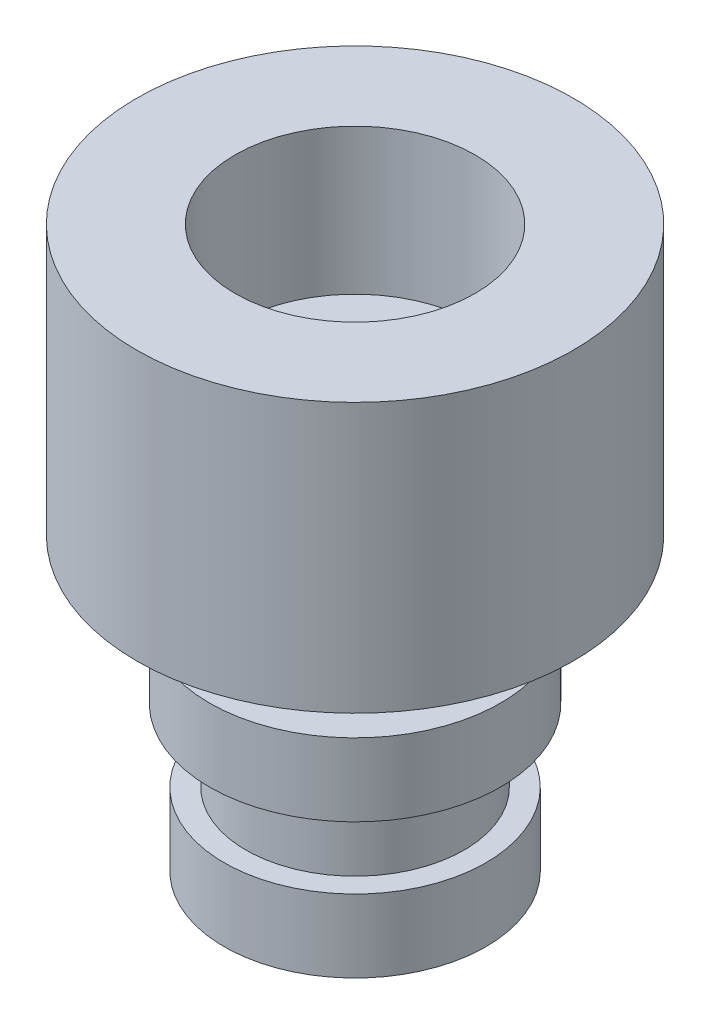
ISO-10303-21;
HEADER;
FILE_DESCRIPTION(('STEP AP214'),'2;1');
FILE_NAME('part.step','',(''),(''),'','','');
FILE_SCHEMA(('AUTOMOTIVE_DESIGN { 1 0 10303 214 1 1 1 1 }'));
ENDSEC;
DATA;
#1=APPLICATION_CONTEXT('core data for automotive mechanical design processes');
#2=APPLICATION_PROTOCOL_DEFINITION('international standard','automotive_design',2000,#1);
#3=PRODUCT_CONTEXT('',#1,'mechanical');
#4=PRODUCT('Part','Part','',(#3));
#5=PRODUCT_RELATED_PRODUCT_CATEGORY('part','',(#4));
#6=PRODUCT_DEFINITION_FORMATION('','',#4);
#7=PRODUCT_DEFINITION_CONTEXT('part definition',#1,'design');
#8=PRODUCT_DEFINITION('design','',#6,#7);
#9=PRODUCT_DEFINITION_SHAPE('','',#8);
#10=(LENGTH_UNIT() NAMED_UNIT(*) SI_UNIT(.MILLI.,.METRE.));
#11=(NAMED_UNIT(*) PLANE_ANGLE_UNIT() SI_UNIT($,.RADIAN.));
#12=(NAMED_UNIT(*) SI_UNIT($,.STERADIAN.) SOLID_ANGLE_UNIT());
#13=UNCERTAINTY_MEASURE_WITH_UNIT(LENGTH_MEASURE(1.E-05),#10,'distance_accuracy_value','');
#14=(GEOMETRIC_REPRESENTATION_CONTEXT(3) GLOBAL_UNCERTAINTY_ASSIGNED_CONTEXT((#13)) GLOBAL_UNIT_ASSIGNED_CONTEXT((#10,
#11,#12)) REPRESENTATION_CONTEXT('',''));
#15=CARTESIAN_POINT('',(0.,0.,0.));
#16=DIRECTION('',(0.,0.,1.));
#17=DIRECTION('',(1.,0.,0.));
#18=AXIS2_PLACEMENT_3D('',#15,#16,#17);
#19=CARTESIAN_POINT('',(-0.522013311509166,-4.,-0.51113803418606));
#20=DIRECTION('',(0.,1.,0.));
#21=DIRECTION('',(0.,0.,1.));
#22=AXIS2_PLACEMENT_3D('',#19,#20,#21);
#23=CYLINDRICAL_SURFACE('',#22,1.5);
#24=CARTESIAN_POINT('',(-0.522013311509166,-2.,-0.51113803418606));
#25=DIRECTION('',(0.,-1.,0.));
#26=DIRECTION('',(0.,0.,-1.));
#27=AXIS2_PLACEMENT_3D('',#24,#25,#26);
#28=CIRCLE('',#27,1.5);
#29=CARTESIAN_POINT('',(-0.522013311509166,-2.,-2.01113803418606));
#30=VERTEX_POINT('',#29);
#31=EDGE_CURVE('E53',#30,#30,#28,.T.);
#32=ORIENTED_EDGE('',*,*,#31,.T.);
#33=EDGE_LOOP('',(#32));
#34=FACE_BOUND('',#33,.T.);
#35=CARTESIAN_POINT('',(-0.522013311509166,-3.,-0.51113803418606));
#36=DIRECTION('',(0.,-1.,0.));
#37=DIRECTION('',(0.,0.,-1.));
#38=AXIS2_PLACEMENT_3D('',#35,#36,#37);
#39=CIRCLE('',#38,1.5);
#40=CARTESIAN_POINT('',(-0.522013311509166,-3.,-2.01113803418606));
#41=VERTEX_POINT('',#40);
#42=EDGE_CURVE('E10',#41,#41,#39,.T.);
#43=ORIENTED_EDGE('',*,*,#42,.F.);
#44=EDGE_LOOP('',(#43));
#45=FACE_BOUND('',#44,.T.);
#46=ADVANCED_FACE('F45',(#34,#45),#23,.T.);
#47=CARTESIAN_POINT('',(-0.522013311509166,3.7,-0.51113803418606));
#48=DIRECTION('',(0.,-1.,0.));
#49=DIRECTION('',(0.,0.,-1.));
#50=AXIS2_PLACEMENT_3D('',#47,#48,#49);
#51=CYLINDRICAL_SURFACE('',#50,3.);
#52=CARTESIAN_POINT('',(-0.522013311509166,3.7,-0.51113803418606));
#53=DIRECTION('',(0.,1.,0.));
#54=DIRECTION('',(0.,0.,1.));
#55=AXIS2_PLACEMENT_3D('',#52,#53,#54);
#56=CIRCLE('',#55,3.);
#57=CARTESIAN_POINT('',(-0.522013311509166,3.7,2.48886196581394));
#58=VERTEX_POINT('',#57);
#59=EDGE_CURVE('E64',#58,#58,#56,.T.);
#60=ORIENTED_EDGE('',*,*,#59,.F.);
#61=EDGE_LOOP('',(#60));
#62=FACE_BOUND('',#61,.T.);
#63=CARTESIAN_POINT('',(-0.522013311509166,0.,-0.51113803418606));
#64=DIRECTION('',(0.,1.,0.));
#65=DIRECTION('',(0.,0.,1.));
#66=AXIS2_PLACEMENT_3D('',#63,#64,#65);
#67=CIRCLE('',#66,3.);
#68=CARTESIAN_POINT('',(-0.522013311509166,0.,2.48886196581394));
#69=VERTEX_POINT('',#68);
#70=EDGE_CURVE('E82',#69,#69,#67,.T.);
#71=ORIENTED_EDGE('',*,*,#70,.T.);
#72=EDGE_LOOP('',(#71));
#73=FACE_BOUND('',#72,.T.);
#74=ADVANCED_FACE('F47',(#62,#73),#51,.T.);
#75=CARTESIAN_POINT('',(-0.522013311509166,3.7,-0.51113803418606));
#76=DIRECTION('',(0.,1.,0.));
#77=DIRECTION('',(0.,0.,1.));
#78=AXIS2_PLACEMENT_3D('',#75,#76,#77);
#79=PLANE('',#78);
#80=CARTESIAN_POINT('',(-0.522013311509166,3.7,-0.51113803418606));
#81=DIRECTION('',(0.,1.,0.));
#82=DIRECTION('',(0.,0.,1.));
#83=AXIS2_PLACEMENT_3D('',#80,#81,#82);
#84=CIRCLE('',#83,1.65);
#85=CARTESIAN_POINT('',(-0.522013311509166,3.7,1.13886196581394));
#86=VERTEX_POINT('',#85);
#87=EDGE_CURVE('E255',#86,#86,#84,.T.);
#88=ORIENTED_EDGE('',*,*,#87,.F.);
#89=EDGE_LOOP('',(#88));
#90=FACE_BOUND('',#89,.T.);
#91=ORIENTED_EDGE('',*,*,#59,.T.);
#92=EDGE_LOOP('',(#91));
#93=FACE_BOUND('',#92,.T.);
#94=ADVANCED_FACE('F94',(#90,#93),#79,.T.);
#95=CARTESIAN_POINT('',(-0.522013311509166,0.,-0.51113803418606));
#96=DIRECTION('',(0.,1.,0.));
#97=DIRECTION('',(0.,0.,1.));
#98=AXIS2_PLACEMENT_3D('',#95,#96,#97);
#99=PLANE('',#98);
#100=CARTESIAN_POINT('',(-0.522013311509166,0.,-0.51113803418606));
#101=DIRECTION('',(0.,-1.,0.));
#102=DIRECTION('',(0.,0.,-1.));
#103=AXIS2_PLACEMENT_3D('',#100,#101,#102);
#104=CIRCLE('',#103,1.5);
#105=CARTESIAN_POINT('',(-0.522013311509166,0.,-2.01113803418606));
#106=VERTEX_POINT('',#105);
#107=EDGE_CURVE('E58',#106,#106,#104,.T.);
#108=ORIENTED_EDGE('',*,*,#107,.F.);
#109=EDGE_LOOP('',(#108));
#110=FACE_BOUND('',#109,.T.);
#111=ORIENTED_EDGE('',*,*,#70,.F.);
#112=EDGE_LOOP('',(#111));
#113=FACE_BOUND('',#112,.T.);
#114=ADVANCED_FACE('F91',(#110,#113),#99,.F.);
#115=CARTESIAN_POINT('',(-0.522013311509166,-1.,-0.51113803418606));
#116=DIRECTION('',(0.,1.,0.));
#117=DIRECTION('',(0.,0.,1.));
#118=AXIS2_PLACEMENT_3D('',#115,#116,#117);
#119=CYLINDRICAL_SURFACE('',#118,1.5);
#120=CARTESIAN_POINT('',(-0.522013311509166,-1.,-0.51113803418606));
#121=DIRECTION('',(0.,-1.,0.));
#122=DIRECTION('',(0.,0.,-1.));
#123=AXIS2_PLACEMENT_3D('',#120,#121,#122);
#124=CIRCLE('',#123,1.5);
#125=CARTESIAN_POINT('',(-0.522013311509166,-1.,-2.01113803418606));
#126=VERTEX_POINT('',#125);
#127=EDGE_CURVE('E74',#126,#126,#124,.T.);
#128=ORIENTED_EDGE('',*,*,#127,.F.);
#129=EDGE_LOOP('',(#128));
#130=FACE_BOUND('',#129,.T.);
#131=ORIENTED_EDGE('',*,*,#107,.T.);
#132=EDGE_LOOP('',(#131));
#133=FACE_BOUND('',#132,.T.);
#134=ADVANCED_FACE('F93',(#130,#133),#119,.T.);
#135=CARTESIAN_POINT('',(-0.522013311509166,-2.,-0.51113803418606));
#136=DIRECTION('',(0.,1.,0.));
#137=DIRECTION('',(0.,0.,1.));
#138=AXIS2_PLACEMENT_3D('',#135,#136,#137);
#139=CYLINDRICAL_SURFACE('',#138,2.);
#140=CARTESIAN_POINT('',(-0.522013311509166,-2.,-0.51113803418606));
#141=DIRECTION('',(0.,-1.,0.));
#142=DIRECTION('',(0.,0.,-1.));
#143=AXIS2_PLACEMENT_3D('',#140,#141,#142);
#144=CIRCLE('',#143,2.);
#145=CARTESIAN_POINT('',(-0.522013311509166,-2.,-2.51113803418606));
#146=VERTEX_POINT('',#145);
#147=EDGE_CURVE('E70',#146,#146,#144,.T.);
#148=ORIENTED_EDGE('',*,*,#147,.F.);
#149=EDGE_LOOP('',(#148));
#150=FACE_BOUND('',#149,.T.);
#151=CARTESIAN_POINT('',(-0.522013311509166,-1.,-0.51113803418606));
#152=DIRECTION('',(0.,-1.,0.));
#153=DIRECTION('',(0.,0.,-1.));
#154=AXIS2_PLACEMENT_3D('',#151,#152,#153);
#155=CIRCLE('',#154,2.);
#156=CARTESIAN_POINT('',(-0.522013311509166,-1.,-2.51113803418606));
#157=VERTEX_POINT('',#156);
#158=EDGE_CURVE('E75',#157,#157,#155,.T.);
#159=ORIENTED_EDGE('',*,*,#158,.T.);
#160=EDGE_LOOP('',(#159));
#161=FACE_BOUND('',#160,.T.);
#162=ADVANCED_FACE('F100',(#150,#161),#139,.T.);
#163=CARTESIAN_POINT('',(-0.522013311509166,-2.,-0.51113803418606));
#164=DIRECTION('',(0.,-1.,0.));
#165=DIRECTION('',(0.,0.,-1.));
#166=AXIS2_PLACEMENT_3D('',#163,#164,#165);
#167=PLANE('',#166);
#168=ORIENTED_EDGE('',*,*,#31,.F.);
#169=EDGE_LOOP('',(#168));
#170=FACE_BOUND('',#169,.T.);
#171=ORIENTED_EDGE('',*,*,#147,.T.);
#172=EDGE_LOOP('',(#171));
#173=FACE_BOUND('',#172,.T.);
#174=ADVANCED_FACE('F117',(#170,#173),#167,.T.);
#175=CARTESIAN_POINT('',(-0.522013311509166,-1.,-0.51113803418606));
#176=DIRECTION('',(0.,-1.,0.));
#177=DIRECTION('',(0.,0.,-1.));
#178=AXIS2_PLACEMENT_3D('',#175,#176,#177);
#179=PLANE('',#178);
#180=ORIENTED_EDGE('',*,*,#127,.T.);
#181=EDGE_LOOP('',(#180));
#182=FACE_BOUND('',#181,.T.);
#183=ORIENTED_EDGE('',*,*,#158,.F.);
#184=EDGE_LOOP('',(#183));
#185=FACE_BOUND('',#184,.T.);
#186=ADVANCED_FACE('F120',(#182,#185),#179,.F.);
#187=CARTESIAN_POINT('',(-0.522013311509166,-3.,-0.51113803418606));
#188=DIRECTION('',(0.,-1.,0.));
#189=DIRECTION('',(0.,0.,-1.));
#190=AXIS2_PLACEMENT_3D('',#187,#188,#189);
#191=CYLINDRICAL_SURFACE('',#190,1.8);
#192=CARTESIAN_POINT('',(-0.522013311509166,-3.,-0.51113803418606));
#193=DIRECTION('',(0.,-1.,0.));
#194=DIRECTION('',(0.,0.,-1.));
#195=AXIS2_PLACEMENT_3D('',#192,#193,#194);
#196=CIRCLE('',#195,1.8);
#197=CARTESIAN_POINT('',(-0.522013311509166,-3.,-2.31113803418606));
#198=VERTEX_POINT('',#197);
#199=EDGE_CURVE('E79',#198,#198,#196,.T.);
#200=ORIENTED_EDGE('',*,*,#199,.T.);
#201=EDGE_LOOP('',(#200));
#202=FACE_BOUND('',#201,.T.);
#203=CARTESIAN_POINT('',(-0.522013311509166,-4.,-0.51113803418606));
#204=DIRECTION('',(0.,-1.,0.));
#205=DIRECTION('',(0.,0.,-1.));
#206=AXIS2_PLACEMENT_3D('',#203,#204,#205);
#207=CIRCLE('',#206,1.8);
#208=CARTESIAN_POINT('',(-0.522013311509166,-4.,-2.31113803418606));
#209=VERTEX_POINT('',#208);
#210=EDGE_CURVE('E68',#209,#209,#207,.T.);
#211=ORIENTED_EDGE('',*,*,#210,.F.);
#212=EDGE_LOOP('',(#211));
#213=FACE_BOUND('',#212,.T.);
#214=ADVANCED_FACE('F124',(#202,#213),#191,.T.);
#215=CARTESIAN_POINT('',(-0.522013311509166,-3.,-0.51113803418606));
#216=DIRECTION('',(0.,-1.,0.));
#217=DIRECTION('',(0.,0.,-1.));
#218=AXIS2_PLACEMENT_3D('',#215,#216,#217);
#219=PLANE('',#218);
#220=ORIENTED_EDGE('',*,*,#42,.T.);
#221=EDGE_LOOP('',(#220));
#222=FACE_BOUND('',#221,.T.);
#223=ORIENTED_EDGE('',*,*,#199,.F.);
#224=EDGE_LOOP('',(#223));
#225=FACE_BOUND('',#224,.T.);
#226=ADVANCED_FACE('F151',(#222,#225),#219,.F.);
#227=CARTESIAN_POINT('',(-0.522013311509166,-4.,-0.51113803418606));
#228=DIRECTION('',(0.,-1.,0.));
#229=DIRECTION('',(0.,0.,-1.));
#230=AXIS2_PLACEMENT_3D('',#227,#228,#229);
#231=PLANE('',#230);
#232=ORIENTED_EDGE('',*,*,#210,.T.);
#233=EDGE_LOOP('',(#232));
#234=FACE_BOUND('',#233,.T.);
#235=ADVANCED_FACE('F115',(#234),#231,.T.);
#236=CARTESIAN_POINT('',(-0.522013311509166,1.7,-0.51113803418606));
#237=DIRECTION('',(0.,1.,0.));
#238=DIRECTION('',(0.,0.,1.));
#239=AXIS2_PLACEMENT_3D('',#236,#237,#238);
#240=CYLINDRICAL_SURFACE('',#239,1.65);
#241=CARTESIAN_POINT('',(-0.522013311509166,1.7,-0.51113803418606));
#242=DIRECTION('',(0.,1.,0.));
#243=DIRECTION('',(0.,0.,1.));
#244=AXIS2_PLACEMENT_3D('',#241,#242,#243);
#245=CIRCLE('',#244,1.65);
#246=CARTESIAN_POINT('',(-0.522013311509166,1.7,1.13886196581394));
#247=VERTEX_POINT('',#246);
#248=EDGE_CURVE('E253',#247,#247,#245,.T.);
#249=ORIENTED_EDGE('',*,*,#248,.F.);
#250=EDGE_LOOP('',(#249));
#251=FACE_BOUND('',#250,.T.);
#252=ORIENTED_EDGE('',*,*,#87,.T.);
#253=EDGE_LOOP('',(#252));
#254=FACE_BOUND('',#253,.T.);
#255=ADVANCED_FACE('F164',(#251,#254),#240,.F.);
#256=CARTESIAN_POINT('',(-0.522013311509166,1.7,-0.51113803418606));
#257=DIRECTION('',(0.,1.,0.));
#258=DIRECTION('',(0.,0.,1.));
#259=AXIS2_PLACEMENT_3D('',#256,#257,#258);
#260=PLANE('',#259);
#261=ORIENTED_EDGE('',*,*,#248,.T.);
#262=EDGE_LOOP('',(#261));
#263=FACE_BOUND('',#262,.T.);
#264=ADVANCED_FACE('F172',(#263),#260,.T.);
#265=CLOSED_SHELL('',(#46,#74,#94,#114,#134,#162,#174,#186,#214,#226,#235,#255,#264));
#266=MANIFOLD_SOLID_BREP('B2',#265);
#267=ADVANCED_BREP_SHAPE_REPRESENTATION('',(#18,#266),#14);
#268=SHAPE_DEFINITION_REPRESENTATION(#9,#267);
ENDSEC;
END-ISO-10303-21;
